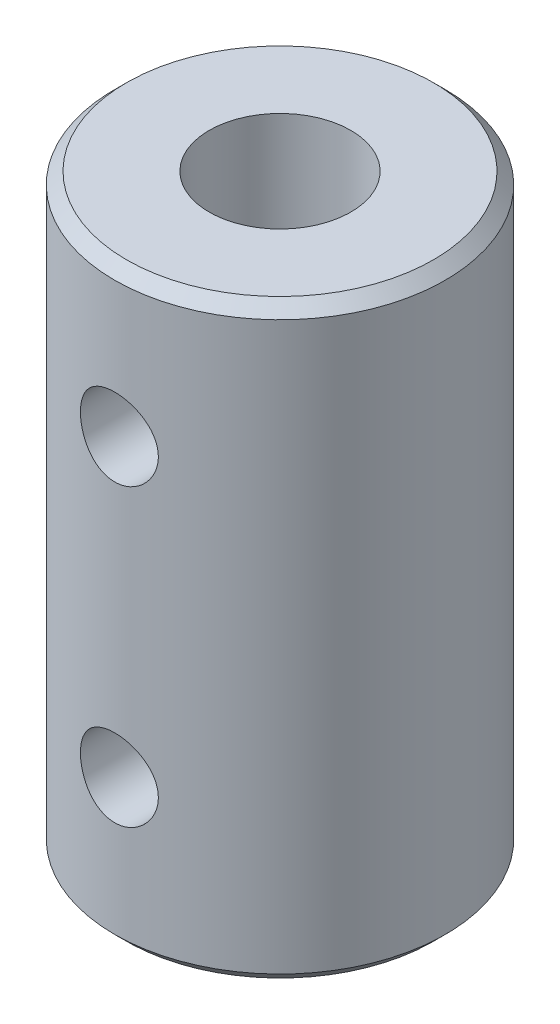
ISO-10303-21;
HEADER;
FILE_DESCRIPTION(('STEP AP214'),'2;1');
FILE_NAME('part.step','',(''),(''),'','','');
FILE_SCHEMA(('AUTOMOTIVE_DESIGN { 1 0 10303 214 1 1 1 1 }'));
ENDSEC;
DATA;
#1=APPLICATION_CONTEXT('core data for automotive mechanical design processes');
#2=APPLICATION_PROTOCOL_DEFINITION('international standard','automotive_design',2000,#1);
#3=PRODUCT_CONTEXT('',#1,'mechanical');
#4=PRODUCT('Part','Part','',(#3));
#5=PRODUCT_RELATED_PRODUCT_CATEGORY('part','',(#4));
#6=PRODUCT_DEFINITION_FORMATION('','',#4);
#7=PRODUCT_DEFINITION_CONTEXT('part definition',#1,'design');
#8=PRODUCT_DEFINITION('design','',#6,#7);
#9=PRODUCT_DEFINITION_SHAPE('','',#8);
#10=(LENGTH_UNIT() NAMED_UNIT(*) SI_UNIT(.MILLI.,.METRE.));
#11=(NAMED_UNIT(*) PLANE_ANGLE_UNIT() SI_UNIT($,.RADIAN.));
#12=(NAMED_UNIT(*) SI_UNIT($,.STERADIAN.) SOLID_ANGLE_UNIT());
#13=UNCERTAINTY_MEASURE_WITH_UNIT(LENGTH_MEASURE(1.E-05),#10,'distance_accuracy_value','');
#14=(GEOMETRIC_REPRESENTATION_CONTEXT(3) GLOBAL_UNCERTAINTY_ASSIGNED_CONTEXT((#13)) GLOBAL_UNIT_ASSIGNED_CONTEXT((#10,
#11,#12)) REPRESENTATION_CONTEXT('',''));
#15=CARTESIAN_POINT('',(0.,0.,0.));
#16=DIRECTION('',(0.,0.,1.));
#17=DIRECTION('',(1.,0.,0.));
#18=AXIS2_PLACEMENT_3D('',#15,#16,#17);
#19=CARTESIAN_POINT('',(0.,0.,-7.));
#20=DIRECTION('',(0.,-1.,0.));
#21=DIRECTION('',(0.,0.,-1.));
#22=AXIS2_PLACEMENT_3D('',#19,#20,#21);
#23=PLANE('',#22);
#24=CARTESIAN_POINT('',(0.,0.,0.));
#25=DIRECTION('',(0.,-1.,0.));
#26=DIRECTION('',(0.,0.,-1.));
#27=AXIS2_PLACEMENT_3D('',#24,#25,#26);
#28=CIRCLE('',#27,6.50000000000001);
#29=CARTESIAN_POINT('',(0.,0.,-6.50000000000001));
#30=VERTEX_POINT('',#29);
#31=EDGE_CURVE('E48',#30,#30,#28,.T.);
#32=ORIENTED_EDGE('',*,*,#31,.T.);
#33=EDGE_LOOP('',(#32));
#34=FACE_BOUND('',#33,.T.);
#35=CARTESIAN_POINT('',(0.,0.,0.));
#36=DIRECTION('',(0.,-1.,0.));
#37=DIRECTION('',(0.,0.,-1.));
#38=AXIS2_PLACEMENT_3D('',#35,#36,#37);
#39=CIRCLE('',#38,4.);
#40=CARTESIAN_POINT('',(0.,0.,-4.));
#41=VERTEX_POINT('',#40);
#42=EDGE_CURVE('E53',#41,#41,#39,.T.);
#43=ORIENTED_EDGE('',*,*,#42,.F.);
#44=EDGE_LOOP('',(#43));
#45=FACE_BOUND('',#44,.T.);
#46=ADVANCED_FACE('F33',(#34,#45),#23,.T.);
#47=CARTESIAN_POINT('',(0.,0.,0.));
#48=DIRECTION('',(0.,-1.,0.));
#49=DIRECTION('',(0.,0.,-1.));
#50=AXIS2_PLACEMENT_3D('',#47,#48,#49);
#51=CYLINDRICAL_SURFACE('',#50,4.);
#52=CARTESIAN_POINT('',(1.65,6.25,3.64383040220041));
#53=CARTESIAN_POINT('',(1.64999056813102,6.16190351977432,3.64383945275153));
#54=CARTESIAN_POINT('',(1.64289989177358,6.07365956802641,3.64707173267573));
#55=CARTESIAN_POINT('',(1.61480845546373,5.89971293892112,3.65959209124688));
#56=CARTESIAN_POINT('',(1.5937695789634,5.8140178994024,3.66889676295874));
#57=CARTESIAN_POINT('',(1.53873536249638,5.64799706186937,3.69231325052125));
#58=CARTESIAN_POINT('',(1.50479212400174,5.5676511797814,3.70640571161012));
#59=CARTESIAN_POINT('',(1.42506535594207,5.41381823316578,3.73778230052357));
#60=CARTESIAN_POINT('',(1.37928479159595,5.34032945721597,3.75506562873472));
#61=CARTESIAN_POINT('',(1.27419856290372,5.1977713121535,3.7920553041855));
#62=CARTESIAN_POINT('',(1.2142851824136,5.12917074421979,3.81184277704779));
#63=CARTESIAN_POINT('',(1.08391072165483,5.00264522809124,3.85094363418237));
#64=CARTESIAN_POINT('',(1.01344563996364,4.94472434852778,3.87025683535296));
#65=CARTESIAN_POINT('',(0.860301943593382,4.83882862869814,3.90721575035942));
#66=CARTESIAN_POINT('',(0.77723239011359,4.79137906729384,3.92475616703247));
#67=CARTESIAN_POINT('',(0.603436361875857,4.7113298546783,3.95520283117798));
#68=CARTESIAN_POINT('',(0.512713242513044,4.67872373565344,3.96811109652272));
#69=CARTESIAN_POINT('',(0.331105172304398,4.63097929334377,3.98726403378776));
#70=CARTESIAN_POINT('',(0.240465625184492,4.61503315207677,3.99381564337609));
#71=CARTESIAN_POINT('',(0.0575763551498647,4.59845334814483,4.0006306156112));
#72=CARTESIAN_POINT('',(-0.0346727137709556,4.59781360467799,4.00089647540931));
#73=CARTESIAN_POINT('',(-0.212297380895985,4.61143649613659,3.99529224160632));
#74=CARTESIAN_POINT('',(-0.297754665400397,4.6248121837171,3.98978733384658));
#75=CARTESIAN_POINT('',(-0.465085845235279,4.66456881744776,3.97375926025944));
#76=CARTESIAN_POINT('',(-0.546959476205493,4.69095072129068,3.96323572489496));
#77=CARTESIAN_POINT('',(-0.706295606817229,4.75628766172018,3.93798907731602));
#78=CARTESIAN_POINT('',(-0.78367197976247,4.79542798992487,3.92320447216362));
#79=CARTESIAN_POINT('',(-0.930960489992467,4.8849912791866,3.89088763760773));
#80=CARTESIAN_POINT('',(-1.00086999453932,4.9354182005033,3.87335444442336));
#81=CARTESIAN_POINT('',(-1.13638530947041,5.05018823902863,3.83587133640027));
#82=CARTESIAN_POINT('',(-1.20135746318645,5.11525341089872,3.8158381454309));
#83=CARTESIAN_POINT('',(-1.31973838423493,5.25540966632157,3.77653142784555));
#84=CARTESIAN_POINT('',(-1.37314286572202,5.3305044492633,3.75725818494773));
#85=CARTESIAN_POINT('',(-1.46845339844828,5.49159840354731,3.72106607156909));
#86=CARTESIAN_POINT('',(-1.50994179309277,5.57786757169265,3.70424107982558));
#87=CARTESIAN_POINT('',(-1.57754508127096,5.75704667140589,3.67596385006485));
#88=CARTESIAN_POINT('',(-1.60367071206121,5.84995191387381,3.66450786071417));
#89=CARTESIAN_POINT('',(-1.63821320355942,6.03342289518498,3.64919091711418));
#90=CARTESIAN_POINT('',(-1.64765569454682,6.12375830118286,3.64489111171831));
#91=CARTESIAN_POINT('',(-1.65157101672826,6.3048056296986,3.64311980380967));
#92=CARTESIAN_POINT('',(-1.64604885780402,6.39551741605928,3.64564601607449));
#93=CARTESIAN_POINT('',(-1.62112710501826,6.56880100904947,3.65678944366161));
#94=CARTESIAN_POINT('',(-1.60261202118543,6.65152817967461,3.66501803861664));
#95=CARTESIAN_POINT('',(-1.55339580262015,6.81263706437997,3.68614612916707));
#96=CARTESIAN_POINT('',(-1.52269185697123,6.89101777135166,3.69904670212356));
#97=CARTESIAN_POINT('',(-1.44853902204985,7.04487900569564,3.72872477858182));
#98=CARTESIAN_POINT('',(-1.40460979308264,7.12010019477925,3.74564214050945));
#99=CARTESIAN_POINT('',(-1.30573455409451,7.26246016942973,3.78124523189864));
#100=CARTESIAN_POINT('',(-1.25078384473683,7.32959548773512,3.79993171387674));
#101=CARTESIAN_POINT('',(-1.12627542162099,7.45942962644671,3.83876011670653));
#102=CARTESIAN_POINT('',(-1.05590387126704,7.52135173704872,3.85889967217623));
#103=CARTESIAN_POINT('',(-0.905297980080103,7.63264285566207,3.89698114804694));
#104=CARTESIAN_POINT('',(-0.825063002026904,7.6820110520032,3.91492292631236));
#105=CARTESIAN_POINT('',(-0.656516816883268,7.76670413420679,3.94668767391886));
#106=CARTESIAN_POINT('',(-0.568191273870492,7.80200347500273,3.96050313975063));
#107=CARTESIAN_POINT('',(-0.386140833605178,7.85699165685875,3.98237104121021));
#108=CARTESIAN_POINT('',(-0.292419112817561,7.87668958293894,3.9904268305481));
#109=CARTESIAN_POINT('',(-0.109187189544836,7.89878822892048,3.9994889299446));
#110=CARTESIAN_POINT('',(-0.0198303081186358,7.90228482874194,4.00094173424749));
#111=CARTESIAN_POINT('',(0.158161739195411,7.89481456562972,3.99786220239438));
#112=CARTESIAN_POINT('',(0.246797024648479,7.88385015000455,3.99333087896147));
#113=CARTESIAN_POINT('',(0.417705375935875,7.84855535786444,3.979024148364));
#114=CARTESIAN_POINT('',(0.50009237162785,7.82469555788545,3.96943363922012));
#115=CARTESIAN_POINT('',(0.659667355734158,7.76479588512001,3.94605480923815));
#116=CARTESIAN_POINT('',(0.736854343148742,7.72875367521332,3.93226568297162));
#117=CARTESIAN_POINT('',(0.887661133732617,7.64369547331361,3.90105808483759));
#118=CARTESIAN_POINT('',(0.960964214361148,7.59416874322707,3.88350423911689));
#119=CARTESIAN_POINT('',(1.09852932170704,7.48429715321,3.84685709666619));
#120=CARTESIAN_POINT('',(1.1627880603165,7.42394837691919,3.82776324400832));
#121=CARTESIAN_POINT('',(1.28487769945047,7.28941247264534,3.78859741195737));
#122=CARTESIAN_POINT('',(1.34199767947157,7.21457224311507,3.76854475207571));
#123=CARTESIAN_POINT('',(1.4429647467733,7.05573402431894,3.73105419200533));
#124=CARTESIAN_POINT('',(1.48680449811903,6.97173100829041,3.7136177396712));
#125=CARTESIAN_POINT('',(1.55944447766651,6.79727155873011,3.68370387904713));
#126=CARTESIAN_POINT('',(1.58834112875234,6.7068608919089,3.67119480418033));
#127=CARTESIAN_POINT('',(1.63017263567573,6.52195285592164,3.65281837075146));
#128=CARTESIAN_POINT('',(1.64316103312974,6.42747030912313,3.64692873900432));
#129=CARTESIAN_POINT('',(1.6493120932942,6.30513668635736,3.64414054419779));
#130=CARTESIAN_POINT('',(1.6500029523216,6.27757556771498,3.64382756923722));
#131=CARTESIAN_POINT('',(1.65,6.25,3.64383040220041));
#132=B_SPLINE_CURVE_WITH_KNOTS('',3,(#52,#53,#54,#55,#56,#57,#58,#59,#60,#61,#62,#63,#64,#65,
#66,#67,#68,#69,#70,#71,#72,#73,#74,#75,#76,#77,#78,#79,#80,#81,#82,#83,#84,#85,#86,#87,#88,#89,
#90,#91,#92,#93,#94,#95,#96,#97,#98,#99,#100,#101,#102,#103,#104,#105,#106,#107,#108,#109,#110,
#111,#112,#113,#114,#115,#116,#117,#118,#119,#120,#121,#122,#123,#124,#125,#126,#127,#128,#129,
#130,#131),.UNSPECIFIED.,.T.,.F.,(4,2,2,2,2,2,2,2,2,2,2,2,2,2,2,2,2,2,2,2,2,2,2,2,2,2,2,2,2,2,2,
2,2,2,2,2,2,2,2,4),(0.,0.264211724660745,0.529148459018597,0.793026677872049,1.05683885985756,
1.33523297260792,1.61373292676209,1.90403076094908,2.19420198072699,2.4695381624427,
2.74476495901024,3.00356896819766,3.26239203686791,3.5251552692474,3.78801084539545,
4.06907613148064,4.35024537535724,4.64031806272423,4.9301877724111,5.20152035698263,
5.47276211576042,5.72713321026166,5.9815630002888,6.24665916965708,6.51186861189123,
6.79815687284346,7.08446363898863,7.3712879145617,7.6579450434915,7.92489841526079,
8.19180661499935,8.44957452423759,8.70739191275388,8.97680852354694,9.24632283025306,
9.53374725602175,9.82133016535516,10.1070334851925,10.3917725616094,10.4744749384332),.UNSPECIFIED.);
#133=CARTESIAN_POINT('',(1.65,6.25,3.64383040220041));
#134=VERTEX_POINT('',#133);
#135=EDGE_CURVE('E73',#134,#134,#132,.T.);
#136=ORIENTED_EDGE('',*,*,#135,.F.);
#137=EDGE_LOOP('',(#136));
#138=FACE_BOUND('',#137,.T.);
#139=ORIENTED_EDGE('',*,*,#42,.T.);
#140=EDGE_LOOP('',(#139));
#141=FACE_BOUND('',#140,.T.);
#142=CARTESIAN_POINT('',(0.,12.5,0.));
#143=DIRECTION('',(0.,-1.,0.));
#144=DIRECTION('',(0.,0.,-1.));
#145=AXIS2_PLACEMENT_3D('',#142,#143,#144);
#146=CIRCLE('',#145,3.99999999999999);
#147=CARTESIAN_POINT('',(0.,12.5,-3.99999999999999));
#148=VERTEX_POINT('',#147);
#149=EDGE_CURVE('E56',#148,#148,#146,.T.);
#150=ORIENTED_EDGE('',*,*,#149,.F.);
#151=EDGE_LOOP('',(#150));
#152=FACE_BOUND('',#151,.T.);
#153=ADVANCED_FACE('F110',(#138,#141,#152),#51,.F.);
#154=CARTESIAN_POINT('',(0.,12.5,-3.99999999999999));
#155=DIRECTION('',(0.,-1.,0.));
#156=DIRECTION('',(0.,0.,-1.));
#157=AXIS2_PLACEMENT_3D('',#154,#155,#156);
#158=PLANE('',#157);
#159=ORIENTED_EDGE('',*,*,#149,.T.);
#160=EDGE_LOOP('',(#159));
#161=FACE_BOUND('',#160,.T.);
#162=CARTESIAN_POINT('',(0.,12.5,0.));
#163=DIRECTION('',(0.,-1.,0.));
#164=DIRECTION('',(0.,0.,-1.));
#165=AXIS2_PLACEMENT_3D('',#162,#163,#164);
#166=CIRCLE('',#165,3.);
#167=CARTESIAN_POINT('',(0.,12.5,-3.));
#168=VERTEX_POINT('',#167);
#169=EDGE_CURVE('E59',#168,#168,#166,.T.);
#170=ORIENTED_EDGE('',*,*,#169,.F.);
#171=EDGE_LOOP('',(#170));
#172=FACE_BOUND('',#171,.T.);
#173=ADVANCED_FACE('F113',(#161,#172),#158,.T.);
#174=CARTESIAN_POINT('',(0.,0.,0.));
#175=DIRECTION('',(0.,-1.,0.));
#176=DIRECTION('',(0.,0.,-1.));
#177=AXIS2_PLACEMENT_3D('',#174,#175,#176);
#178=CYLINDRICAL_SURFACE('',#177,3.);
#179=CARTESIAN_POINT('',(1.65,18.75,2.50549396327351));
#180=CARTESIAN_POINT('',(1.64999358115515,18.6654377558758,2.50550290729145));
#181=CARTESIAN_POINT('',(1.64345412095508,18.5808015803563,2.50984278304633));
#182=CARTESIAN_POINT('',(1.61768357796129,18.4142419893439,2.52652305472093));
#183=CARTESIAN_POINT('',(1.5984310983052,18.3323233922629,2.5388769381334));
#184=CARTESIAN_POINT('',(1.54839133504121,18.1739418416584,2.56969514424061));
#185=CARTESIAN_POINT('',(1.51767597794516,18.0974483363602,2.58812128253767));
#186=CARTESIAN_POINT('',(1.44580368027316,17.9507292506767,2.62894573960704));
#187=CARTESIAN_POINT('',(1.40464456372702,17.8805049806212,2.65134488586739));
#188=CARTESIAN_POINT('',(1.30818987552103,17.7405069795139,2.70034227169485));
#189=CARTESIAN_POINT('',(1.25188597568528,17.6714961430797,2.72713610292843));
#190=CARTESIAN_POINT('',(1.12882249865068,17.5432845752438,2.78033402122329));
#191=CARTESIAN_POINT('',(1.06205670422282,17.4840897205544,2.8067378662503));
#192=CARTESIAN_POINT('',(0.912984038802343,17.372187212475,2.85888255333956));
#193=CARTESIAN_POINT('',(0.829835009326254,17.3204729108744,2.88437182872328));
#194=CARTESIAN_POINT('',(0.654349556397895,17.2321220938197,2.92916377464779));
#195=CARTESIAN_POINT('',(0.562020200659686,17.1954740891042,2.94847115688416));
#196=CARTESIAN_POINT('',(0.378922854343174,17.1415060152004,2.9772938233039));
#197=CARTESIAN_POINT('',(0.28866376218831,17.1228318567281,2.98749000620555));
#198=CARTESIAN_POINT('',(0.105768848971927,17.1008252216481,2.99953120217528));
#199=CARTESIAN_POINT('',(0.0131348834272894,17.0974811140014,3.00138254652496));
#200=CARTESIAN_POINT('',(-0.161456942743376,17.1058401237369,2.99679126383707));
#201=CARTESIAN_POINT('',(-0.243517036042414,17.116004301038,2.99119680588262));
#202=CARTESIAN_POINT('',(-0.404548934713677,17.1482561393333,2.97370139090637));
#203=CARTESIAN_POINT('',(-0.483520502425805,17.170344715974,2.96179994958743));
#204=CARTESIAN_POINT('',(-0.637279429786405,17.2258175954501,2.93258792133284));
#205=CARTESIAN_POINT('',(-0.71201258706549,17.2593209512549,2.91522047737549));
#206=CARTESIAN_POINT('',(-0.854941741305336,17.3364314461422,2.87655421939416));
#207=CARTESIAN_POINT('',(-0.923135637298119,17.380041817185,2.85525414826244));
#208=CARTESIAN_POINT('',(-1.05891717191853,17.4814847500415,2.80791814382438));
#209=CARTESIAN_POINT('',(-1.12564617195585,17.5403439308726,2.78161920172535));
#210=CARTESIAN_POINT('',(-1.24879377983835,17.6679242054498,2.7285563799978));
#211=CARTESIAN_POINT('',(-1.30520164705459,17.7366554412585,2.70179204741387));
#212=CARTESIAN_POINT('',(-1.41104757147093,17.8892979542294,2.64816260741379));
#213=CARTESIAN_POINT('',(-1.45943898084593,17.9740121749765,2.62149493557528));
#214=CARTESIAN_POINT('',(-1.54096072440202,18.1520876587557,2.57442669454811));
#215=CARTESIAN_POINT('',(-1.57410870202277,18.2454387738951,2.55401888906632));
#216=CARTESIAN_POINT('',(-1.621324807476,18.430382433914,2.52428868885372));
#217=CARTESIAN_POINT('',(-1.63671808149072,18.5215077071812,2.51420388175754));
#218=CARTESIAN_POINT('',(-1.65197600548299,18.7055614326045,2.50421132283931));
#219=CARTESIAN_POINT('',(-1.65185841284551,18.7984877010052,2.50429193328554));
#220=CARTESIAN_POINT('',(-1.63731066997579,18.9689806967755,2.51381291635781));
#221=CARTESIAN_POINT('',(-1.6249632757909,19.0468167627882,2.52189118280773));
#222=CARTESIAN_POINT('',(-1.58963092545288,19.1990948427084,2.54430898316227));
#223=CARTESIAN_POINT('',(-1.56664130047228,19.2735353511972,2.55865126498177));
#224=CARTESIAN_POINT('',(-1.50974087534156,19.4205684143407,2.59264701052962));
#225=CARTESIAN_POINT('',(-1.47541058671725,19.492950820695,2.61249886195853));
#226=CARTESIAN_POINT('',(-1.39715088074391,19.631361532983,2.65517525628181));
#227=CARTESIAN_POINT('',(-1.35321671440463,19.6973866719826,2.67800126759515));
#228=CARTESIAN_POINT('',(-1.24890384728535,19.832175982833,2.72838745980259));
#229=CARTESIAN_POINT('',(-1.18702256034847,19.8997166554536,2.75612471210542));
#230=CARTESIAN_POINT('',(-1.05259034248067,20.0239446345824,2.81021466477288));
#231=CARTESIAN_POINT('',(-0.980033198593373,20.0806255766059,2.83656654669951));
#232=CARTESIAN_POINT('',(-0.821591432017619,20.1841835647783,2.88655886174343));
#233=CARTESIAN_POINT('',(-0.735218364495385,20.2304198077817,2.90999476284885));
#234=CARTESIAN_POINT('',(-0.554269536180263,20.3072143053759,2.94980224898629));
#235=CARTESIAN_POINT('',(-0.459702424085393,20.3377888605615,2.96618117604292));
#236=CARTESIAN_POINT('',(-0.275417797995457,20.3793061183918,2.98862325067975));
#237=CARTESIAN_POINT('',(-0.186187129425338,20.3919309693444,2.99556705432428));
#238=CARTESIAN_POINT('',(-0.00661676308886604,20.4024318934345,3.00133436858647));
#239=CARTESIAN_POINT('',(0.0837223254250921,20.4003157358196,3.00016215675142));
#240=CARTESIAN_POINT('',(0.25435836629703,20.3823300715381,2.99031042427524));
#241=CARTESIAN_POINT('',(0.334831363047832,20.3677063332057,2.98231104671828));
#242=CARTESIAN_POINT('',(0.491985833876877,20.3270351780095,2.96044701025379));
#243=CARTESIAN_POINT('',(0.568666854326147,20.3009863980447,2.94658165149358));
#244=CARTESIAN_POINT('',(0.719080279481092,20.2373873679604,2.91359875185443));
#245=CARTESIAN_POINT('',(0.792622296205402,20.199474405955,2.89431787940932));
#246=CARTESIAN_POINT('',(0.932542405269454,20.1136744985123,2.85231650614788));
#247=CARTESIAN_POINT('',(0.998917583844718,20.0657835194005,2.82959461529654));
#248=CARTESIAN_POINT('',(1.13072210629174,19.9550739983496,2.77974517125015));
#249=CARTESIAN_POINT('',(1.19516495605846,19.8911721662743,2.75241145940814));
#250=CARTESIAN_POINT('',(1.31290440702821,19.7534928624481,2.69823878537054));
#251=CARTESIAN_POINT('',(1.36618742691371,19.6797035347267,2.67140046184162));
#252=CARTESIAN_POINT('',(1.46345962344263,19.5182759999486,2.61945108088931));
#253=CARTESIAN_POINT('',(1.50659692748028,19.4300436014073,2.59457299089604));
#254=CARTESIAN_POINT('',(1.57680093269354,19.2458211995913,2.55252885584285));
#255=CARTESIAN_POINT('',(1.60391885150154,19.1498570471718,2.53533827536757));
#256=CARTESIAN_POINT('',(1.6313948659609,19.0021912169415,2.5176692541321));
#257=CARTESIAN_POINT('',(1.6383544404993,18.95212523584,2.51313062613142));
#258=CARTESIAN_POINT('',(1.64765888075615,18.8513816875925,2.50704033236465));
#259=CARTESIAN_POINT('',(1.65000384878586,18.8007041340309,2.50548860037557));
#260=CARTESIAN_POINT('',(1.65,18.75,2.50549396327351));
#261=B_SPLINE_CURVE_WITH_KNOTS('',3,(#179,#180,#181,#182,#183,#184,#185,#186,#187,#188,#189,
#190,#191,#192,#193,#194,#195,#196,#197,#198,#199,#200,#201,#202,#203,#204,#205,#206,#207,#208,
#209,#210,#211,#212,#213,#214,#215,#216,#217,#218,#219,#220,#221,#222,#223,#224,#225,#226,#227,
#228,#229,#230,#231,#232,#233,#234,#235,#236,#237,#238,#239,#240,#241,#242,#243,#244,#245,#246,
#247,#248,#249,#250,#251,#252,#253,#254,#255,#256,#257,#258,#259,#260),.UNSPECIFIED.,.T.,.F.,(4,
2,2,2,2,2,2,2,2,2,2,2,2,2,2,2,2,2,2,2,2,2,2,2,2,2,2,2,2,2,2,2,2,2,2,2,2,2,2,2,4),(0.,
0.25347146497891,0.507370630471961,0.75970272371841,1.0120874338999,1.28998079678324,
1.56803993512379,1.86997289364919,2.17167517502776,2.44828286528195,2.72468065617497,
2.97213663093979,3.21961160997027,3.46975098230537,3.71997045333204,3.99717687977863,
4.27467015892955,4.57652503396566,4.8780296436106,5.15517475627462,5.43200258623579,
5.66859462056208,5.905290548121,6.15196333618108,6.39875837770523,6.68465599353131,
6.97072065421034,7.27125286686232,7.57147164850533,7.84111747203333,8.1106211895083,
8.35604451303954,8.60149712555499,8.85533990697406,9.10928550569675,9.39243346006448,
9.67592402360688,9.97823556729934,10.2795752459721,10.4315619419379,10.5835452681421),.UNSPECIFIED.);
#262=CARTESIAN_POINT('',(1.65,18.75,2.50549396327351));
#263=VERTEX_POINT('',#262);
#264=EDGE_CURVE('E94',#263,#263,#261,.T.);
#265=ORIENTED_EDGE('',*,*,#264,.F.);
#266=EDGE_LOOP('',(#265));
#267=FACE_BOUND('',#266,.T.);
#268=ORIENTED_EDGE('',*,*,#169,.T.);
#269=EDGE_LOOP('',(#268));
#270=FACE_BOUND('',#269,.T.);
#271=CARTESIAN_POINT('',(0.,25.,0.));
#272=DIRECTION('',(0.,-1.,0.));
#273=DIRECTION('',(0.,0.,-1.));
#274=AXIS2_PLACEMENT_3D('',#271,#272,#273);
#275=CIRCLE('',#274,3.);
#276=CARTESIAN_POINT('',(0.,25.,-3.));
#277=VERTEX_POINT('',#276);
#278=EDGE_CURVE('E62',#277,#277,#275,.T.);
#279=ORIENTED_EDGE('',*,*,#278,.F.);
#280=EDGE_LOOP('',(#279));
#281=FACE_BOUND('',#280,.T.);
#282=ADVANCED_FACE('F121',(#267,#270,#281),#178,.F.);
#283=CARTESIAN_POINT('',(0.,25.,-3.));
#284=DIRECTION('',(0.,1.,0.));
#285=DIRECTION('',(0.,0.,1.));
#286=AXIS2_PLACEMENT_3D('',#283,#284,#285);
#287=PLANE('',#286);
#288=CARTESIAN_POINT('',(0.,25.,0.));
#289=DIRECTION('',(0.,1.,0.));
#290=DIRECTION('',(0.,0.,1.));
#291=AXIS2_PLACEMENT_3D('',#288,#289,#290);
#292=CIRCLE('',#291,6.49999999999999);
#293=CARTESIAN_POINT('',(0.,25.,6.49999999999999));
#294=VERTEX_POINT('',#293);
#295=EDGE_CURVE('E10',#294,#294,#292,.T.);
#296=ORIENTED_EDGE('',*,*,#295,.T.);
#297=EDGE_LOOP('',(#296));
#298=FACE_BOUND('',#297,.T.);
#299=ORIENTED_EDGE('',*,*,#278,.T.);
#300=EDGE_LOOP('',(#299));
#301=FACE_BOUND('',#300,.T.);
#302=ADVANCED_FACE('F127',(#298,#301),#287,.T.);
#303=CARTESIAN_POINT('',(0.,0.,0.));
#304=DIRECTION('',(0.,-1.,0.));
#305=DIRECTION('',(0.,0.,-1.));
#306=AXIS2_PLACEMENT_3D('',#303,#304,#305);
#307=CYLINDRICAL_SURFACE('',#306,7.);
#308=CARTESIAN_POINT('',(1.65,18.75,6.80275679412398));
#309=CARTESIAN_POINT('',(1.64999713007316,18.8412890000235,6.80275861136205));
#310=CARTESIAN_POINT('',(1.64239813439995,18.9326109983811,6.80461440498174));
#311=CARTESIAN_POINT('',(1.61224414767597,19.112644563434,6.81182064992733));
#312=CARTESIAN_POINT('',(1.58967946321205,19.2013543992886,6.81717336620826));
#313=CARTESIAN_POINT('',(1.53035515036094,19.3735335125234,6.83073431325551));
#314=CARTESIAN_POINT('',(1.49361254058449,19.4570089339595,6.83893911932177));
#315=CARTESIAN_POINT('',(1.40702581854957,19.6166165327901,6.85727558075245));
#316=CARTESIAN_POINT('',(1.3571815350499,19.6927486141879,6.86740726130097));
#317=CARTESIAN_POINT('',(1.24476461908352,19.836999828686,6.88867782513987));
#318=CARTESIAN_POINT('',(1.18198309355867,19.9049540452772,6.89983131541127));
#319=CARTESIAN_POINT('',(1.04592427298928,20.0294717117012,6.92176152937785));
#320=CARTESIAN_POINT('',(0.972646078487495,20.0860341843775,6.93253822068664));
#321=CARTESIAN_POINT('',(0.816555491676993,20.1868269698173,6.95266103704034));
#322=CARTESIAN_POINT('',(0.733636814479662,20.2308968612328,6.96198791366554));
#323=CARTESIAN_POINT('',(0.561312838562633,20.3044129082778,6.97799434603916));
#324=CARTESIAN_POINT('',(0.471908389601369,20.3338609756902,6.98467424785277));
#325=CARTESIAN_POINT('',(0.290868022052411,20.3767737021711,6.99453084372035));
#326=CARTESIAN_POINT('',(0.199301775715457,20.390517993967,6.99776875317269));
#327=CARTESIAN_POINT('',(0.0151097839078758,20.4025091367613,7.00058928212562));
#328=CARTESIAN_POINT('',(-0.0775158200378369,20.400758034263,7.00017238432294));
#329=CARTESIAN_POINT('',(-0.259263367840034,20.3820125949898,6.99577641572094));
#330=CARTESIAN_POINT('',(-0.34841838031907,20.3653198849955,6.99186783471482));
#331=CARTESIAN_POINT('',(-0.522624624983762,20.3176479255643,6.98100889430398));
#332=CARTESIAN_POINT('',(-0.607675652983101,20.2866679660991,6.97405838372646));
#333=CARTESIAN_POINT('',(-0.772074386794553,20.2110462296067,6.95778608866946));
#334=CARTESIAN_POINT('',(-0.851369239725047,20.1662938295303,6.94844521053821));
#335=CARTESIAN_POINT('',(-1.00143136070301,20.064480774115,6.92841069918988));
#336=CARTESIAN_POINT('',(-1.07219729215003,20.007418193499,6.91771685448099));
#337=CARTESIAN_POINT('',(-1.20498965605832,19.880975474906,6.89584251761335));
#338=CARTESIAN_POINT('',(-1.26676421005725,19.8113315043055,6.88465650871199));
#339=CARTESIAN_POINT('',(-1.37780936391993,19.6625556788502,6.86329717958811));
#340=CARTESIAN_POINT('',(-1.42707950447265,19.5834234756316,6.85312389657327));
#341=CARTESIAN_POINT('',(-1.51185477157774,19.4174647401929,6.83492437266263));
#342=CARTESIAN_POINT('',(-1.54730546989208,19.3306094060491,6.82690665922475));
#343=CARTESIAN_POINT('',(-1.6030277151278,19.1519387224308,6.8140390867396));
#344=CARTESIAN_POINT('',(-1.62330210645788,19.0601243058692,6.80918863409247));
#345=CARTESIAN_POINT('',(-1.64769127898038,18.8764614430508,6.80332774943589));
#346=CARTESIAN_POINT('',(-1.65217579860456,18.7846648402699,6.80222947433876));
#347=CARTESIAN_POINT('',(-1.64586488795024,18.6016354234163,6.80375919481422));
#348=CARTESIAN_POINT('',(-1.63507069283233,18.5104025643681,6.80638688917233));
#349=CARTESIAN_POINT('',(-1.59883140460811,18.3324225492525,6.81498886694796));
#350=CARTESIAN_POINT('',(-1.57359604251707,18.2456301543463,6.82091521063605));
#351=CARTESIAN_POINT('',(-1.50942069873872,18.0775063133655,6.83540229380027));
#352=CARTESIAN_POINT('',(-1.47047923644584,17.9961754584062,6.84396331787599));
#353=CARTESIAN_POINT('',(-1.37920410959564,17.8397009434106,6.86294389007106));
#354=CARTESIAN_POINT('',(-1.32664621508517,17.7646918152575,6.87339357272798));
#355=CARTESIAN_POINT('',(-1.20991829013253,17.6244219937018,6.89489755256543));
#356=CARTESIAN_POINT('',(-1.14574657256198,17.5591627191684,6.90595193742742));
#357=CARTESIAN_POINT('',(-1.00592681617982,17.4387770179575,6.92771364919943));
#358=CARTESIAN_POINT('',(-0.930057660220529,17.3839046445284,6.93840801965822));
#359=CARTESIAN_POINT('',(-0.769965220758947,17.2876819832221,6.95799159344945));
#360=CARTESIAN_POINT('',(-0.685742356354559,17.246331017435,6.96688088727283));
#361=CARTESIAN_POINT('',(-0.511894272134559,17.1786621610667,6.9817988702489));
#362=CARTESIAN_POINT('',(-0.422310877248033,17.1522413254324,6.98784709878863));
#363=CARTESIAN_POINT('',(-0.239816201973849,17.1148671310585,6.99648655479454));
#364=CARTESIAN_POINT('',(-0.146905491020367,17.1039111385267,6.99907837091255));
#365=CARTESIAN_POINT('',(0.0372082467747375,17.0979118694287,7.00049202890772));
#366=CARTESIAN_POINT('',(0.128398504210689,17.102491675739,6.9994031706394));
#367=CARTESIAN_POINT('',(0.308670729816519,17.1265802472947,6.99377268350157));
#368=CARTESIAN_POINT('',(0.397752748359331,17.1460886554734,6.98923113721447));
#369=CARTESIAN_POINT('',(0.570933576895644,17.1992882389107,6.97721604451341));
#370=CARTESIAN_POINT('',(0.655052149359148,17.2329181294887,6.96975517685192));
#371=CARTESIAN_POINT('',(0.816498795364762,17.3133490089208,6.95269208722048));
#372=CARTESIAN_POINT('',(0.893826099578999,17.3601514874724,6.94308962308136));
#373=CARTESIAN_POINT('',(1.04130725997213,17.4667860964467,6.92252474173611));
#374=CARTESIAN_POINT('',(1.11126948147334,17.5268784697949,6.91153737485731));
#375=CARTESIAN_POINT('',(1.24024523339421,17.6578723975111,6.88956325338245));
#376=CARTESIAN_POINT('',(1.29925605605595,17.7287766172591,6.87857649960749));
#377=CARTESIAN_POINT('',(1.40557849643651,17.8807545938553,6.85764827463158));
#378=CARTESIAN_POINT('',(1.45268661539722,17.9619736114787,6.84772646444862));
#379=CARTESIAN_POINT('',(1.53250931126199,18.1313973337531,6.83030721412674));
#380=CARTESIAN_POINT('',(1.56523518241758,18.2195964924945,6.82280787287529));
#381=CARTESIAN_POINT('',(1.61002842680637,18.3814691544095,6.81235745600281));
#382=CARTESIAN_POINT('',(1.62498700416516,18.4543160048443,6.80878274857867));
#383=CARTESIAN_POINT('',(1.64497362976398,18.6014346815323,6.8039817559383));
#384=CARTESIAN_POINT('',(1.65000233562816,18.6757064130911,6.80275531520391));
#385=CARTESIAN_POINT('',(1.65,18.75,6.80275679412398));
#386=B_SPLINE_CURVE_WITH_KNOTS('',3,(#308,#309,#310,#311,#312,#313,#314,#315,#316,#317,#318,
#319,#320,#321,#322,#323,#324,#325,#326,#327,#328,#329,#330,#331,#332,#333,#334,#335,#336,#337,
#338,#339,#340,#341,#342,#343,#344,#345,#346,#347,#348,#349,#350,#351,#352,#353,#354,#355,#356,
#357,#358,#359,#360,#361,#362,#363,#364,#365,#366,#367,#368,#369,#370,#371,#372,#373,#374,#375,
#376,#377,#378,#379,#380,#381,#382,#383,#384,#385),.UNSPECIFIED.,.T.,.F.,(4,2,2,2,2,2,2,2,2,2,2,
2,2,2,2,2,2,2,2,2,2,2,2,2,2,2,2,2,2,2,2,2,2,2,2,2,2,2,4),(0.,0.273594440399262,
0.547366263700775,0.820810479503747,1.09425826944911,1.37252656286893,1.65081871531698,
1.9325374796075,2.21421939985748,2.49080324523182,2.76735056224876,3.03843805884697,
3.30953902903524,3.5828770280852,3.85625780745004,4.13623055025586,4.41621357550839,
4.69728844125184,4.97831061353603,5.25270687968444,5.52708096437946,5.79756789407089,
6.06808405216623,6.34337456664897,6.61870510445458,6.90008328124663,7.18144734868654,
7.46084693391317,7.74019892930651,8.01282246332763,8.28543947686366,8.55688541369868,
8.82836206089266,9.10571835709369,9.38314313916058,9.66503130549496,9.94669771026971,
10.1693714016501,10.3920303455577),.UNSPECIFIED.);
#387=CARTESIAN_POINT('',(1.65,18.75,6.80275679412398));
#388=VERTEX_POINT('',#387);
#389=EDGE_CURVE('E99',#388,#388,#386,.T.);
#390=ORIENTED_EDGE('',*,*,#389,.F.);
#391=EDGE_LOOP('',(#390));
#392=FACE_BOUND('',#391,.T.);
#393=CARTESIAN_POINT('',(1.65,6.25,6.80275679412398));
#394=CARTESIAN_POINT('',(1.64999713007316,6.34128900002348,6.80275861136205));
#395=CARTESIAN_POINT('',(1.64239813439995,6.43261099838109,6.80461440498174));
#396=CARTESIAN_POINT('',(1.61224414767597,6.61264456343403,6.81182064992733));
#397=CARTESIAN_POINT('',(1.58967946321205,6.70135439928855,6.81717336620826));
#398=CARTESIAN_POINT('',(1.53035515036094,6.87353351252337,6.83073431325551));
#399=CARTESIAN_POINT('',(1.49361254058449,6.9570089339595,6.83893911932177));
#400=CARTESIAN_POINT('',(1.40702581854958,7.11661653279005,6.85727558075245));
#401=CARTESIAN_POINT('',(1.3571815350499,7.19274861418793,6.86740726130097));
#402=CARTESIAN_POINT('',(1.24476461908352,7.33699982868595,6.88867782513987));
#403=CARTESIAN_POINT('',(1.18198309355868,7.40495404527719,6.89983131541127));
#404=CARTESIAN_POINT('',(1.04592427298928,7.52947171170117,6.92176152937784));
#405=CARTESIAN_POINT('',(0.972646078487496,7.58603418437752,6.93253822068664));
#406=CARTESIAN_POINT('',(0.816555491676995,7.68682696981727,6.95266103704034));
#407=CARTESIAN_POINT('',(0.733636814479665,7.73089686123284,6.96198791366554));
#408=CARTESIAN_POINT('',(0.561312838562636,7.80441290827776,6.97799434603916));
#409=CARTESIAN_POINT('',(0.471908389601372,7.83386097569016,6.98467424785277));
#410=CARTESIAN_POINT('',(0.290868022052414,7.87677370217112,6.99453084372035));
#411=CARTESIAN_POINT('',(0.19930177571546,7.89051799396695,6.99776875317269));
#412=CARTESIAN_POINT('',(0.0151097839078775,7.90250913676126,7.00058928212562));
#413=CARTESIAN_POINT('',(-0.0775158200378355,7.90075803426303,7.00017238432294));
#414=CARTESIAN_POINT('',(-0.259263367840033,7.88201259498984,6.99577641572094));
#415=CARTESIAN_POINT('',(-0.348418380319069,7.86531988499546,6.99186783471482));
#416=CARTESIAN_POINT('',(-0.522624624983761,7.81764792556426,6.98100889430398));
#417=CARTESIAN_POINT('',(-0.6076756529831,7.78666796609913,6.97405838372646));
#418=CARTESIAN_POINT('',(-0.772074386794551,7.71104622960672,6.95778608866946));
#419=CARTESIAN_POINT('',(-0.851369239725045,7.66629382953033,6.94844521053821));
#420=CARTESIAN_POINT('',(-1.00143136070301,7.56448077411501,6.92841069918988));
#421=CARTESIAN_POINT('',(-1.07219729215003,7.50741819349895,6.91771685448099));
#422=CARTESIAN_POINT('',(-1.20498965605832,7.38097547490599,6.89584251761335));
#423=CARTESIAN_POINT('',(-1.26676421005725,7.31133150430551,6.88465650871199));
#424=CARTESIAN_POINT('',(-1.37780936391993,7.1625556788502,6.8632971795881));
#425=CARTESIAN_POINT('',(-1.42707950447265,7.08342347563159,6.85312389657327));
#426=CARTESIAN_POINT('',(-1.51185477157774,6.91746474019295,6.83492437266263));
#427=CARTESIAN_POINT('',(-1.54730546989208,6.83060940604915,6.82690665922475));
#428=CARTESIAN_POINT('',(-1.6030277151278,6.65193872243084,6.8140390867396));
#429=CARTESIAN_POINT('',(-1.62330210645788,6.56012430586923,6.80918863409247));
#430=CARTESIAN_POINT('',(-1.64769127898038,6.37646144305076,6.80332774943589));
#431=CARTESIAN_POINT('',(-1.65217579860456,6.28466484026994,6.80222947433876));
#432=CARTESIAN_POINT('',(-1.64586488795024,6.10163542341626,6.80375919481422));
#433=CARTESIAN_POINT('',(-1.63507069283233,6.01040256436811,6.80638688917233));
#434=CARTESIAN_POINT('',(-1.59883140460811,5.83242254925253,6.81498886694796));
#435=CARTESIAN_POINT('',(-1.57359604251707,5.74563015434625,6.82091521063605));
#436=CARTESIAN_POINT('',(-1.50942069873872,5.57750631336549,6.83540229380027));
#437=CARTESIAN_POINT('',(-1.47047923644584,5.49617545840622,6.84396331787599));
#438=CARTESIAN_POINT('',(-1.37920410959564,5.33970094341062,6.86294389007106));
#439=CARTESIAN_POINT('',(-1.32664621508517,5.26469181525747,6.87339357272798));
#440=CARTESIAN_POINT('',(-1.20991829013253,5.12442199370178,6.89489755256543));
#441=CARTESIAN_POINT('',(-1.14574657256198,5.05916271916839,6.90595193742742));
#442=CARTESIAN_POINT('',(-1.00592681617982,4.93877701795745,6.92771364919943));
#443=CARTESIAN_POINT('',(-0.93005766022053,4.88390464452841,6.93840801965822));
#444=CARTESIAN_POINT('',(-0.769965220758948,4.78768198322209,6.95799159344945));
#445=CARTESIAN_POINT('',(-0.685742356354559,4.74633101743495,6.96688088727282));
#446=CARTESIAN_POINT('',(-0.511894272134559,4.67866216106669,6.98179887024889));
#447=CARTESIAN_POINT('',(-0.422310877248034,4.65224132543239,6.98784709878863));
#448=CARTESIAN_POINT('',(-0.23981620197385,4.61486713105854,6.99648655479454));
#449=CARTESIAN_POINT('',(-0.146905491020368,4.60391113852667,6.99907837091255));
#450=CARTESIAN_POINT('',(0.0372082467747361,4.59791186942867,7.00049202890772));
#451=CARTESIAN_POINT('',(0.128398504210687,4.60249167573904,6.9994031706394));
#452=CARTESIAN_POINT('',(0.308670729816517,4.62658024729473,6.99377268350157));
#453=CARTESIAN_POINT('',(0.397752748359329,4.64608865547342,6.98923113721447));
#454=CARTESIAN_POINT('',(0.570933576895641,4.69928823891072,6.97721604451341));
#455=CARTESIAN_POINT('',(0.655052149359145,4.73291812948868,6.96975517685192));
#456=CARTESIAN_POINT('',(0.81649879536476,4.8133490089208,6.95269208722048));
#457=CARTESIAN_POINT('',(0.893826099578997,4.86015148747236,6.94308962308136));
#458=CARTESIAN_POINT('',(1.04130725997213,4.96678609644666,6.92252474173611));
#459=CARTESIAN_POINT('',(1.11126948147334,5.02687846979488,6.91153737485731));
#460=CARTESIAN_POINT('',(1.24024523339421,5.15787239751113,6.88956325338245));
#461=CARTESIAN_POINT('',(1.29925605605595,5.22877661725911,6.8785764996075));
#462=CARTESIAN_POINT('',(1.40557849643651,5.38075459385527,6.85764827463158));
#463=CARTESIAN_POINT('',(1.45268661539722,5.46197361147869,6.84772646444862));
#464=CARTESIAN_POINT('',(1.53250931126199,5.63139733375313,6.83030721412674));
#465=CARTESIAN_POINT('',(1.56523518241758,5.71959649249444,6.82280787287529));
#466=CARTESIAN_POINT('',(1.61002842680637,5.88146915440948,6.81235745600281));
#467=CARTESIAN_POINT('',(1.62498700416516,5.95431600484432,6.80878274857867));
#468=CARTESIAN_POINT('',(1.64497362976398,6.10143468153228,6.8039817559383));
#469=CARTESIAN_POINT('',(1.65000233562816,6.17570641309105,6.80275531520391));
#470=CARTESIAN_POINT('',(1.65,6.25,6.80275679412398));
#471=B_SPLINE_CURVE_WITH_KNOTS('',3,(#393,#394,#395,#396,#397,#398,#399,#400,#401,#402,#403,
#404,#405,#406,#407,#408,#409,#410,#411,#412,#413,#414,#415,#416,#417,#418,#419,#420,#421,#422,
#423,#424,#425,#426,#427,#428,#429,#430,#431,#432,#433,#434,#435,#436,#437,#438,#439,#440,#441,
#442,#443,#444,#445,#446,#447,#448,#449,#450,#451,#452,#453,#454,#455,#456,#457,#458,#459,#460,
#461,#462,#463,#464,#465,#466,#467,#468,#469,#470),.UNSPECIFIED.,.T.,.F.,(4,2,2,2,2,2,2,2,2,2,2,
2,2,2,2,2,2,2,2,2,2,2,2,2,2,2,2,2,2,2,2,2,2,2,2,2,2,2,4),(0.,0.273594440399257,
0.547366263700774,0.820810479503745,1.0942582694491,1.37252656286893,1.65081871531698,
1.93253747960749,2.21421939985748,2.49080324523182,2.76735056224876,3.03843805884697,
3.30953902903524,3.5828770280852,3.85625780745004,4.13623055025586,4.41621357550839,
4.69728844125184,4.97831061353603,5.25270687968444,5.52708096437946,5.79756789407088,
6.06808405216623,6.34337456664897,6.61870510445458,6.90008328124663,7.18144734868654,
7.46084693391317,7.74019892930651,8.01282246332763,8.28543947686366,8.55688541369868,
8.82836206089266,9.10571835709369,9.38314313916058,9.66503130549495,9.94669771026971,
10.1693714016501,10.3920303455577),.UNSPECIFIED.);
#472=CARTESIAN_POINT('',(1.65,6.25,6.80275679412398));
#473=VERTEX_POINT('',#472);
#474=EDGE_CURVE('E65',#473,#473,#471,.T.);
#475=ORIENTED_EDGE('',*,*,#474,.F.);
#476=EDGE_LOOP('',(#475));
#477=FACE_BOUND('',#476,.T.);
#478=CARTESIAN_POINT('',(0.,0.499999999999996,0.));
#479=DIRECTION('',(0.,-1.,0.));
#480=DIRECTION('',(0.,0.,-1.));
#481=AXIS2_PLACEMENT_3D('',#478,#479,#480);
#482=CIRCLE('',#481,7.);
#483=CARTESIAN_POINT('',(0.,0.499999999999996,-7.));
#484=VERTEX_POINT('',#483);
#485=EDGE_CURVE('E40',#484,#484,#482,.F.);
#486=ORIENTED_EDGE('',*,*,#485,.T.);
#487=EDGE_LOOP('',(#486));
#488=FACE_BOUND('',#487,.T.);
#489=CARTESIAN_POINT('',(0.,24.5,0.));
#490=DIRECTION('',(0.,1.,0.));
#491=DIRECTION('',(0.,0.,1.));
#492=AXIS2_PLACEMENT_3D('',#489,#490,#491);
#493=CIRCLE('',#492,7.);
#494=CARTESIAN_POINT('',(0.,24.5,7.));
#495=VERTEX_POINT('',#494);
#496=EDGE_CURVE('E44',#495,#495,#493,.F.);
#497=ORIENTED_EDGE('',*,*,#496,.T.);
#498=EDGE_LOOP('',(#497));
#499=FACE_BOUND('',#498,.T.);
#500=ADVANCED_FACE('F79',(#392,#477,#488,#499),#307,.T.);
#501=CARTESIAN_POINT('',(0.,0.,0.));
#502=DIRECTION('',(0.,1.,0.));
#503=DIRECTION('',(0.,0.,1.));
#504=AXIS2_PLACEMENT_3D('',#501,#502,#503);
#505=CONICAL_SURFACE('',#504,6.50000000000001,0.785398163397445);
#506=ORIENTED_EDGE('',*,*,#485,.F.);
#507=EDGE_LOOP('',(#506));
#508=FACE_BOUND('',#507,.T.);
#509=ORIENTED_EDGE('',*,*,#31,.F.);
#510=EDGE_LOOP('',(#509));
#511=FACE_BOUND('',#510,.T.);
#512=ADVANCED_FACE('F136',(#508,#511),#505,.T.);
#513=CARTESIAN_POINT('',(0.,24.5,0.));
#514=DIRECTION('',(0.,-1.,0.));
#515=DIRECTION('',(0.,0.,-1.));
#516=AXIS2_PLACEMENT_3D('',#513,#514,#515);
#517=CONICAL_SURFACE('',#516,7.,0.785398163397457);
#518=ORIENTED_EDGE('',*,*,#295,.F.);
#519=EDGE_LOOP('',(#518));
#520=FACE_BOUND('',#519,.T.);
#521=ORIENTED_EDGE('',*,*,#496,.F.);
#522=EDGE_LOOP('',(#521));
#523=FACE_BOUND('',#522,.T.);
#524=ADVANCED_FACE('F35',(#520,#523),#517,.T.);
#525=CARTESIAN_POINT('',(0.,6.25,7.));
#526=DIRECTION('',(0.,0.,1.));
#527=DIRECTION('',(1.,0.,0.));
#528=AXIS2_PLACEMENT_3D('',#525,#526,#527);
#529=CYLINDRICAL_SURFACE('',#528,1.65);
#530=ORIENTED_EDGE('',*,*,#474,.T.);
#531=EDGE_LOOP('',(#530));
#532=FACE_BOUND('',#531,.T.);
#533=ORIENTED_EDGE('',*,*,#135,.T.);
#534=EDGE_LOOP('',(#533));
#535=FACE_BOUND('',#534,.T.);
#536=ADVANCED_FACE('F82',(#532,#535),#529,.F.);
#537=CARTESIAN_POINT('',(0.,18.75,7.));
#538=DIRECTION('',(0.,0.,1.));
#539=DIRECTION('',(1.,0.,0.));
#540=AXIS2_PLACEMENT_3D('',#537,#538,#539);
#541=CYLINDRICAL_SURFACE('',#540,1.65);
#542=ORIENTED_EDGE('',*,*,#389,.T.);
#543=EDGE_LOOP('',(#542));
#544=FACE_BOUND('',#543,.T.);
#545=ORIENTED_EDGE('',*,*,#264,.T.);
#546=EDGE_LOOP('',(#545));
#547=FACE_BOUND('',#546,.T.);
#548=ADVANCED_FACE('F86',(#544,#547),#541,.F.);
#549=CLOSED_SHELL('',(#46,#153,#173,#282,#302,#500,#512,#524,#536,#548));
#550=MANIFOLD_SOLID_BREP('B2',#549);
#551=ADVANCED_BREP_SHAPE_REPRESENTATION('',(#18,#550),#14);
#552=SHAPE_DEFINITION_REPRESENTATION(#9,#551);
ENDSEC;
END-ISO-10303-21;
